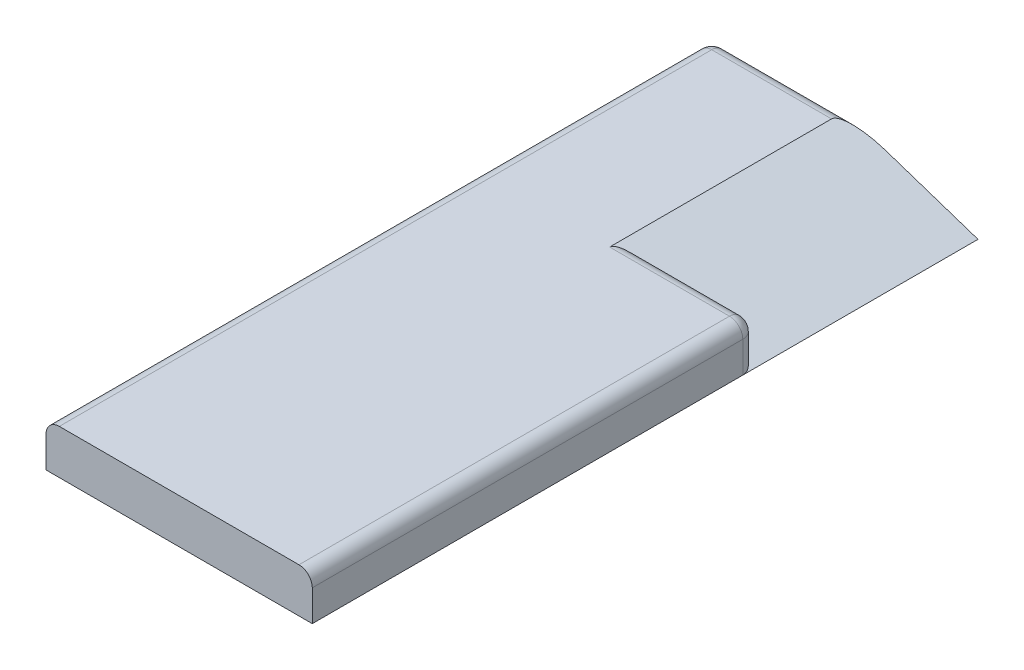
ISO-10303-21;
HEADER;
FILE_DESCRIPTION(('STEP AP214'),'2;1');
FILE_NAME('part.step','',(''),(''),'','','');
FILE_SCHEMA(('AUTOMOTIVE_DESIGN { 1 0 10303 214 1 1 1 1 }'));
ENDSEC;
DATA;
#1=APPLICATION_CONTEXT('core data for automotive mechanical design processes');
#2=APPLICATION_PROTOCOL_DEFINITION('international standard','automotive_design',2000,#1);
#3=PRODUCT_CONTEXT('',#1,'mechanical');
#4=PRODUCT('Part','Part','',(#3));
#5=PRODUCT_RELATED_PRODUCT_CATEGORY('part','',(#4));
#6=PRODUCT_DEFINITION_FORMATION('','',#4);
#7=PRODUCT_DEFINITION_CONTEXT('part definition',#1,'design');
#8=PRODUCT_DEFINITION('design','',#6,#7);
#9=PRODUCT_DEFINITION_SHAPE('','',#8);
#10=(LENGTH_UNIT() NAMED_UNIT(*) SI_UNIT(.MILLI.,.METRE.));
#11=(NAMED_UNIT(*) PLANE_ANGLE_UNIT() SI_UNIT($,.RADIAN.));
#12=(NAMED_UNIT(*) SI_UNIT($,.STERADIAN.) SOLID_ANGLE_UNIT());
#13=UNCERTAINTY_MEASURE_WITH_UNIT(LENGTH_MEASURE(1.E-05),#10,'distance_accuracy_value','');
#14=(GEOMETRIC_REPRESENTATION_CONTEXT(3) GLOBAL_UNCERTAINTY_ASSIGNED_CONTEXT((#13)) GLOBAL_UNIT_ASSIGNED_CONTEXT((#10,
#11,#12)) REPRESENTATION_CONTEXT('',''));
#15=CARTESIAN_POINT('',(0.,0.,0.));
#16=DIRECTION('',(0.,0.,1.));
#17=DIRECTION('',(1.,0.,0.));
#18=AXIS2_PLACEMENT_3D('',#15,#16,#17);
#19=CARTESIAN_POINT('',(-30.,5.,150.));
#20=DIRECTION('',(0.,1.,0.));
#21=DIRECTION('',(0.,0.,1.));
#22=AXIS2_PLACEMENT_3D('',#19,#20,#21);
#23=PLANE('',#22);
#24=DIRECTION('',(1.,0.,0.));
#25=VECTOR('',#24,1.);
#26=CARTESIAN_POINT('',(-30.,5.,150.));
#27=LINE('',#26,#25);
#28=CARTESIAN_POINT('',(-27.,5.,150.));
#29=VERTEX_POINT('',#28);
#30=CARTESIAN_POINT('',(27.,5.,150.));
#31=VERTEX_POINT('',#30);
#32=EDGE_CURVE('E131',#29,#31,#27,.T.);
#33=ORIENTED_EDGE('',*,*,#32,.T.);
#34=DIRECTION('',(0.,0.,-1.));
#35=VECTOR('',#34,1.);
#36=CARTESIAN_POINT('',(27.,5.,150.));
#37=LINE('',#36,#35);
#38=CARTESIAN_POINT('',(27.,5.,53.));
#39=VERTEX_POINT('',#38);
#40=EDGE_CURVE('E222',#31,#39,#37,.T.);
#41=ORIENTED_EDGE('',*,*,#40,.T.);
#42=DIRECTION('',(1.,0.,0.));
#43=VECTOR('',#42,1.);
#44=CARTESIAN_POINT('',(-30.,5.,53.));
#45=LINE('',#44,#43);
#46=CARTESIAN_POINT('',(0.,5.,53.));
#47=VERTEX_POINT('',#46);
#48=EDGE_CURVE('E169',#39,#47,#45,.F.);
#49=ORIENTED_EDGE('',*,*,#48,.T.);
#50=DIRECTION('',(0.,0.,1.));
#51=VECTOR('',#50,1.);
#52=CARTESIAN_POINT('',(0.,5.,-202.330175702983));
#53=LINE('',#52,#51);
#54=CARTESIAN_POINT('',(0.,5.,3.));
#55=VERTEX_POINT('',#54);
#56=EDGE_CURVE('E245',#55,#47,#53,.T.);
#57=ORIENTED_EDGE('',*,*,#56,.F.);
#58=DIRECTION('',(1.,0.,0.));
#59=VECTOR('',#58,1.);
#60=CARTESIAN_POINT('',(-30.,5.,3.));
#61=LINE('',#60,#59);
#62=CARTESIAN_POINT('',(-27.,5.,3.));
#63=VERTEX_POINT('',#62);
#64=EDGE_CURVE('E165',#55,#63,#61,.F.);
#65=ORIENTED_EDGE('',*,*,#64,.T.);
#66=DIRECTION('',(0.,0.,-1.));
#67=VECTOR('',#66,1.);
#68=CARTESIAN_POINT('',(-27.,5.,150.));
#69=LINE('',#68,#67);
#70=EDGE_CURVE('E200',#63,#29,#69,.F.);
#71=ORIENTED_EDGE('',*,*,#70,.T.);
#72=EDGE_LOOP('',(#33,#41,#49,#57,#65,#71));
#73=FACE_BOUND('',#72,.T.);
#74=ADVANCED_FACE('F44',(#73),#23,.T.);
#75=CARTESIAN_POINT('',(-30.,5.,150.));
#76=DIRECTION('',(1.,0.,0.));
#77=DIRECTION('',(0.,1.,0.));
#78=AXIS2_PLACEMENT_3D('',#75,#76,#77);
#79=PLANE('',#78);
#80=DIRECTION('',(0.,0.,-1.));
#81=VECTOR('',#80,1.);
#82=CARTESIAN_POINT('',(-30.,2.,3.));
#83=LINE('',#82,#81);
#84=CARTESIAN_POINT('',(-30.,2.,150.));
#85=VERTEX_POINT('',#84);
#86=CARTESIAN_POINT('',(-30.,2.,3.));
#87=VERTEX_POINT('',#86);
#88=EDGE_CURVE('E184',#85,#87,#83,.T.);
#89=ORIENTED_EDGE('',*,*,#88,.T.);
#90=DIRECTION('',(0.,-1.,0.));
#91=VECTOR('',#90,1.);
#92=CARTESIAN_POINT('',(-30.,-5.,3.));
#93=LINE('',#92,#91);
#94=CARTESIAN_POINT('',(-30.,-5.,3.));
#95=VERTEX_POINT('',#94);
#96=EDGE_CURVE('E187',#87,#95,#93,.T.);
#97=ORIENTED_EDGE('',*,*,#96,.T.);
#98=DIRECTION('',(0.,0.,-1.));
#99=VECTOR('',#98,1.);
#100=CARTESIAN_POINT('',(-30.,-5.,150.));
#101=LINE('',#100,#99);
#102=CARTESIAN_POINT('',(-30.,-5.,150.));
#103=VERTEX_POINT('',#102);
#104=EDGE_CURVE('E146',#103,#95,#101,.T.);
#105=ORIENTED_EDGE('',*,*,#104,.F.);
#106=DIRECTION('',(0.,-1.,0.));
#107=VECTOR('',#106,1.);
#108=CARTESIAN_POINT('',(-30.,5.,150.));
#109=LINE('',#108,#107);
#110=EDGE_CURVE('E136',#85,#103,#109,.T.);
#111=ORIENTED_EDGE('',*,*,#110,.F.);
#112=EDGE_LOOP('',(#89,#97,#105,#111));
#113=FACE_BOUND('',#112,.T.);
#114=ADVANCED_FACE('F284',(#113),#79,.F.);
#115=CARTESIAN_POINT('',(-30.,-5.,150.));
#116=DIRECTION('',(0.,1.,0.));
#117=DIRECTION('',(0.,0.,1.));
#118=AXIS2_PLACEMENT_3D('',#115,#116,#117);
#119=PLANE('',#118);
#120=ORIENTED_EDGE('',*,*,#104,.T.);
#121=CARTESIAN_POINT('',(-27.,-5.,3.));
#122=DIRECTION('',(0.,1.,0.));
#123=DIRECTION('',(0.,0.,1.));
#124=AXIS2_PLACEMENT_3D('',#121,#122,#123);
#125=CIRCLE('',#124,3.);
#126=CARTESIAN_POINT('',(-27.,-5.,0.));
#127=VERTEX_POINT('',#126);
#128=EDGE_CURVE('E191',#95,#127,#125,.F.);
#129=ORIENTED_EDGE('',*,*,#128,.T.);
#130=DIRECTION('',(1.,0.,0.));
#131=VECTOR('',#130,1.);
#132=CARTESIAN_POINT('',(-30.,-5.,0.));
#133=LINE('',#132,#131);
#134=CARTESIAN_POINT('',(30.,-5.,0.));
#135=VERTEX_POINT('',#134);
#136=EDGE_CURVE('E254',#127,#135,#133,.T.);
#137=ORIENTED_EDGE('',*,*,#136,.T.);
#138=DIRECTION('',(0.,0.,1.));
#139=VECTOR('',#138,1.);
#140=CARTESIAN_POINT('',(30.,-5.,-202.330175702983));
#141=LINE('',#140,#139);
#142=CARTESIAN_POINT('',(30.,-5.,53.));
#143=VERTEX_POINT('',#142);
#144=EDGE_CURVE('E144',#135,#143,#141,.T.);
#145=ORIENTED_EDGE('',*,*,#144,.T.);
#146=DIRECTION('',(0.,0.,-1.));
#147=VECTOR('',#146,1.);
#148=CARTESIAN_POINT('',(30.,-5.,150.));
#149=LINE('',#148,#147);
#150=CARTESIAN_POINT('',(30.,-5.,150.));
#151=VERTEX_POINT('',#150);
#152=EDGE_CURVE('E127',#151,#143,#149,.T.);
#153=ORIENTED_EDGE('',*,*,#152,.F.);
#154=DIRECTION('',(1.,0.,0.));
#155=VECTOR('',#154,1.);
#156=CARTESIAN_POINT('',(-30.,-5.,150.));
#157=LINE('',#156,#155);
#158=EDGE_CURVE('E130',#103,#151,#157,.T.);
#159=ORIENTED_EDGE('',*,*,#158,.F.);
#160=EDGE_LOOP('',(#120,#129,#137,#145,#153,#159));
#161=FACE_BOUND('',#160,.T.);
#162=ADVANCED_FACE('F142',(#161),#119,.F.);
#163=CARTESIAN_POINT('',(30.,5.,150.));
#164=DIRECTION('',(1.,0.,0.));
#165=DIRECTION('',(0.,0.,-1.));
#166=AXIS2_PLACEMENT_3D('',#163,#164,#165);
#167=PLANE('',#166);
#168=DIRECTION('',(0.,-1.,0.));
#169=VECTOR('',#168,1.);
#170=CARTESIAN_POINT('',(30.,5.,53.));
#171=LINE('',#170,#169);
#172=CARTESIAN_POINT('',(30.,2.,53.));
#173=VERTEX_POINT('',#172);
#174=EDGE_CURVE('E162',#143,#173,#171,.F.);
#175=ORIENTED_EDGE('',*,*,#174,.T.);
#176=DIRECTION('',(0.,0.,-1.));
#177=VECTOR('',#176,1.);
#178=CARTESIAN_POINT('',(30.,2.,150.));
#179=LINE('',#178,#177);
#180=CARTESIAN_POINT('',(30.,2.,150.));
#181=VERTEX_POINT('',#180);
#182=EDGE_CURVE('E54',#173,#181,#179,.F.);
#183=ORIENTED_EDGE('',*,*,#182,.T.);
#184=DIRECTION('',(0.,-1.,0.));
#185=VECTOR('',#184,1.);
#186=CARTESIAN_POINT('',(30.,5.,150.));
#187=LINE('',#186,#185);
#188=EDGE_CURVE('E123',#181,#151,#187,.T.);
#189=ORIENTED_EDGE('',*,*,#188,.T.);
#190=ORIENTED_EDGE('',*,*,#152,.T.);
#191=EDGE_LOOP('',(#175,#183,#189,#190));
#192=FACE_BOUND('',#191,.T.);
#193=ADVANCED_FACE('F125',(#192),#167,.T.);
#194=CARTESIAN_POINT('',(0.,0.,150.));
#195=DIRECTION('',(0.,0.,-1.));
#196=DIRECTION('',(-1.,0.,0.));
#197=AXIS2_PLACEMENT_3D('',#194,#195,#196);
#198=PLANE('',#197);
#199=ORIENTED_EDGE('',*,*,#188,.F.);
#200=CARTESIAN_POINT('',(27.,2.,150.));
#201=DIRECTION('',(0.,0.,-1.));
#202=DIRECTION('',(-1.,0.,0.));
#203=AXIS2_PLACEMENT_3D('',#200,#201,#202);
#204=CIRCLE('',#203,3.);
#205=EDGE_CURVE('E11',#181,#31,#204,.F.);
#206=ORIENTED_EDGE('',*,*,#205,.T.);
#207=ORIENTED_EDGE('',*,*,#32,.F.);
#208=CARTESIAN_POINT('',(-27.,2.,150.));
#209=DIRECTION('',(0.,0.,-1.));
#210=DIRECTION('',(-1.,0.,0.));
#211=AXIS2_PLACEMENT_3D('',#208,#209,#210);
#212=CIRCLE('',#211,3.);
#213=EDGE_CURVE('E203',#29,#85,#212,.F.);
#214=ORIENTED_EDGE('',*,*,#213,.T.);
#215=ORIENTED_EDGE('',*,*,#110,.T.);
#216=ORIENTED_EDGE('',*,*,#158,.T.);
#217=EDGE_LOOP('',(#199,#206,#207,#214,#215,#216));
#218=FACE_BOUND('',#217,.T.);
#219=ADVANCED_FACE('F134',(#218),#198,.F.);
#220=CARTESIAN_POINT('',(0.,0.,0.));
#221=DIRECTION('',(0.,0.,-1.));
#222=DIRECTION('',(-1.,0.,0.));
#223=AXIS2_PLACEMENT_3D('',#220,#221,#222);
#224=PLANE('',#223);
#225=ORIENTED_EDGE('',*,*,#136,.F.);
#226=DIRECTION('',(0.,-1.,0.));
#227=VECTOR('',#226,1.);
#228=CARTESIAN_POINT('',(-27.,2.,0.));
#229=LINE('',#228,#227);
#230=CARTESIAN_POINT('',(-27.,2.,0.));
#231=VERTEX_POINT('',#230);
#232=EDGE_CURVE('E194',#127,#231,#229,.F.);
#233=ORIENTED_EDGE('',*,*,#232,.T.);
#234=DIRECTION('',(1.,0.,0.));
#235=VECTOR('',#234,1.);
#236=CARTESIAN_POINT('',(0.,2.,0.));
#237=LINE('',#236,#235);
#238=CARTESIAN_POINT('',(9.00000000000001,2.,0.));
#239=VERTEX_POINT('',#238);
#240=EDGE_CURVE('E172',#231,#239,#237,.T.);
#241=ORIENTED_EDGE('',*,*,#240,.T.);
#242=DIRECTION('',(-0.948683298050514,0.316227766016838,0.));
#243=VECTOR('',#242,1.);
#244=CARTESIAN_POINT('',(30.,-5.,0.));
#245=LINE('',#244,#243);
#246=EDGE_CURVE('E250',#135,#239,#245,.T.);
#247=ORIENTED_EDGE('',*,*,#246,.F.);
#248=EDGE_LOOP('',(#225,#233,#241,#247));
#249=FACE_BOUND('',#248,.T.);
#250=ADVANCED_FACE('F262',(#249),#224,.T.);
#251=CARTESIAN_POINT('',(30.,-5.,-202.330175702983));
#252=DIRECTION('',(0.316227766016838,0.948683298050514,0.));
#253=DIRECTION('',(-0.948683298050514,0.316227766016838,0.));
#254=AXIS2_PLACEMENT_3D('',#251,#252,#253);
#255=PLANE('',#254);
#256=ORIENTED_EDGE('',*,*,#246,.T.);
#257=CARTESIAN_POINT('',(9.00000000000001,2.,3.));
#258=DIRECTION('',(0.316227766016838,0.948683298050514,0.));
#259=DIRECTION('',(0.948683298050514,-0.316227766016838,0.));
#260=AXIS2_PLACEMENT_3D('',#257,#258,#259);
#261=ELLIPSE('',#260,9.48683298050513,3.);
#262=EDGE_CURVE('E175',#239,#55,#261,.T.);
#263=ORIENTED_EDGE('',*,*,#262,.T.);
#264=ORIENTED_EDGE('',*,*,#56,.T.);
#265=CARTESIAN_POINT('',(9.00000000000001,2.,53.));
#266=DIRECTION('',(0.316227766016838,0.948683298050514,0.));
#267=DIRECTION('',(0.948683298050514,-0.316227766016838,0.));
#268=AXIS2_PLACEMENT_3D('',#265,#266,#267);
#269=ELLIPSE('',#268,9.48683298050513,3.);
#270=CARTESIAN_POINT('',(9.00000000000001,2.,50.));
#271=VERTEX_POINT('',#270);
#272=EDGE_CURVE('E181',#47,#271,#269,.F.);
#273=ORIENTED_EDGE('',*,*,#272,.T.);
#274=DIRECTION('',(-0.948683298050514,0.316227766016838,0.));
#275=VECTOR('',#274,1.);
#276=CARTESIAN_POINT('',(30.,-5.,50.));
#277=LINE('',#276,#275);
#278=CARTESIAN_POINT('',(27.,-4.,50.));
#279=VERTEX_POINT('',#278);
#280=EDGE_CURVE('E215',#279,#271,#277,.T.);
#281=ORIENTED_EDGE('',*,*,#280,.F.);
#282=CARTESIAN_POINT('',(27.,-4.,53.));
#283=DIRECTION('',(0.316227766016838,0.948683298050514,0.));
#284=DIRECTION('',(0.948683298050514,-0.316227766016838,0.));
#285=AXIS2_PLACEMENT_3D('',#282,#283,#284);
#286=ELLIPSE('',#285,3.16227766016838,3.);
#287=EDGE_CURVE('E178',#279,#143,#286,.F.);
#288=ORIENTED_EDGE('',*,*,#287,.T.);
#289=ORIENTED_EDGE('',*,*,#144,.F.);
#290=EDGE_LOOP('',(#256,#263,#264,#273,#281,#288,#289));
#291=FACE_BOUND('',#290,.T.);
#292=ADVANCED_FACE('F266',(#291),#255,.T.);
#293=CARTESIAN_POINT('',(0.,0.,50.));
#294=DIRECTION('',(0.,0.,-1.));
#295=DIRECTION('',(-1.,0.,0.));
#296=AXIS2_PLACEMENT_3D('',#293,#294,#295);
#297=PLANE('',#296);
#298=DIRECTION('',(1.,0.,0.));
#299=VECTOR('',#298,1.);
#300=CARTESIAN_POINT('',(0.,2.,50.));
#301=LINE('',#300,#299);
#302=CARTESIAN_POINT('',(27.,2.,50.));
#303=VERTEX_POINT('',#302);
#304=EDGE_CURVE('E150',#271,#303,#301,.T.);
#305=ORIENTED_EDGE('',*,*,#304,.T.);
#306=DIRECTION('',(0.,-1.,0.));
#307=VECTOR('',#306,1.);
#308=CARTESIAN_POINT('',(27.,0.,50.));
#309=LINE('',#308,#307);
#310=EDGE_CURVE('E158',#303,#279,#309,.T.);
#311=ORIENTED_EDGE('',*,*,#310,.T.);
#312=ORIENTED_EDGE('',*,*,#280,.T.);
#313=EDGE_LOOP('',(#305,#311,#312));
#314=FACE_BOUND('',#313,.T.);
#315=ADVANCED_FACE('F273',(#314),#297,.T.);
#316=CARTESIAN_POINT('',(0.,2.,53.));
#317=DIRECTION('',(1.,0.,0.));
#318=DIRECTION('',(0.,0.,-1.));
#319=AXIS2_PLACEMENT_3D('',#316,#317,#318);
#320=CYLINDRICAL_SURFACE('',#319,3.);
#321=ORIENTED_EDGE('',*,*,#48,.F.);
#322=CARTESIAN_POINT('',(27.,2.,53.));
#323=DIRECTION('',(1.,0.,0.));
#324=DIRECTION('',(0.,0.,-1.));
#325=AXIS2_PLACEMENT_3D('',#322,#323,#324);
#326=CIRCLE('',#325,3.);
#327=EDGE_CURVE('E219',#39,#303,#326,.F.);
#328=ORIENTED_EDGE('',*,*,#327,.T.);
#329=ORIENTED_EDGE('',*,*,#304,.F.);
#330=ORIENTED_EDGE('',*,*,#272,.F.);
#331=EDGE_LOOP('',(#321,#328,#329,#330));
#332=FACE_BOUND('',#331,.T.);
#333=ADVANCED_FACE('F236',(#332),#320,.T.);
#334=CARTESIAN_POINT('',(27.,0.,53.));
#335=DIRECTION('',(0.,-1.,0.));
#336=DIRECTION('',(0.,0.,-1.));
#337=AXIS2_PLACEMENT_3D('',#334,#335,#336);
#338=CYLINDRICAL_SURFACE('',#337,3.);
#339=ORIENTED_EDGE('',*,*,#310,.F.);
#340=CARTESIAN_POINT('',(27.,2.,53.));
#341=DIRECTION('',(0.,-1.,0.));
#342=DIRECTION('',(0.,0.,-1.));
#343=AXIS2_PLACEMENT_3D('',#340,#341,#342);
#344=CIRCLE('',#343,3.);
#345=EDGE_CURVE('E206',#303,#173,#344,.T.);
#346=ORIENTED_EDGE('',*,*,#345,.T.);
#347=ORIENTED_EDGE('',*,*,#174,.F.);
#348=ORIENTED_EDGE('',*,*,#287,.F.);
#349=EDGE_LOOP('',(#339,#346,#347,#348));
#350=FACE_BOUND('',#349,.T.);
#351=ADVANCED_FACE('F271',(#350),#338,.T.);
#352=CARTESIAN_POINT('',(0.,2.,3.));
#353=DIRECTION('',(1.,0.,0.));
#354=DIRECTION('',(0.,0.,-1.));
#355=AXIS2_PLACEMENT_3D('',#352,#353,#354);
#356=CYLINDRICAL_SURFACE('',#355,3.);
#357=ORIENTED_EDGE('',*,*,#240,.F.);
#358=CARTESIAN_POINT('',(-27.,2.,3.));
#359=DIRECTION('',(1.,0.,0.));
#360=DIRECTION('',(0.,0.,-1.));
#361=AXIS2_PLACEMENT_3D('',#358,#359,#360);
#362=CIRCLE('',#361,3.);
#363=EDGE_CURVE('E197',#231,#63,#362,.T.);
#364=ORIENTED_EDGE('',*,*,#363,.T.);
#365=ORIENTED_EDGE('',*,*,#64,.F.);
#366=ORIENTED_EDGE('',*,*,#262,.F.);
#367=EDGE_LOOP('',(#357,#364,#365,#366));
#368=FACE_BOUND('',#367,.T.);
#369=ADVANCED_FACE('F295',(#368),#356,.T.);
#370=CARTESIAN_POINT('',(-27.,2.,150.));
#371=DIRECTION('',(0.,0.,1.));
#372=DIRECTION('',(1.,0.,0.));
#373=AXIS2_PLACEMENT_3D('',#370,#371,#372);
#374=CYLINDRICAL_SURFACE('',#373,3.);
#375=ORIENTED_EDGE('',*,*,#213,.F.);
#376=ORIENTED_EDGE('',*,*,#70,.F.);
#377=CARTESIAN_POINT('',(-27.,2.,3.));
#378=DIRECTION('',(0.,0.,-1.));
#379=DIRECTION('',(0.,1.,0.));
#380=AXIS2_PLACEMENT_3D('',#377,#378,#379);
#381=CIRCLE('',#380,3.);
#382=EDGE_CURVE('E211',#87,#63,#381,.T.);
#383=ORIENTED_EDGE('',*,*,#382,.F.);
#384=ORIENTED_EDGE('',*,*,#88,.F.);
#385=EDGE_LOOP('',(#375,#376,#383,#384));
#386=FACE_BOUND('',#385,.T.);
#387=ADVANCED_FACE('F299',(#386),#374,.T.);
#388=CARTESIAN_POINT('',(-27.,2.,3.));
#389=DIRECTION('',(1.,0.,0.));
#390=DIRECTION('',(0.,1.,0.));
#391=AXIS2_PLACEMENT_3D('',#388,#389,#390);
#392=SPHERICAL_SURFACE('',#391,3.);
#393=ORIENTED_EDGE('',*,*,#382,.T.);
#394=ORIENTED_EDGE('',*,*,#363,.F.);
#395=CARTESIAN_POINT('',(-27.,2.,3.));
#396=DIRECTION('',(0.,-1.,0.));
#397=DIRECTION('',(1.,0.,0.));
#398=AXIS2_PLACEMENT_3D('',#395,#396,#397);
#399=CIRCLE('',#398,3.);
#400=EDGE_CURVE('E207',#87,#231,#399,.T.);
#401=ORIENTED_EDGE('',*,*,#400,.F.);
#402=EDGE_LOOP('',(#393,#394,#401));
#403=FACE_BOUND('',#402,.T.);
#404=ADVANCED_FACE('F304',(#403),#392,.T.);
#405=CARTESIAN_POINT('',(-27.,5.,3.));
#406=DIRECTION('',(0.,1.,0.));
#407=DIRECTION('',(-1.,0.,0.));
#408=AXIS2_PLACEMENT_3D('',#405,#406,#407);
#409=CYLINDRICAL_SURFACE('',#408,3.);
#410=ORIENTED_EDGE('',*,*,#400,.T.);
#411=ORIENTED_EDGE('',*,*,#232,.F.);
#412=ORIENTED_EDGE('',*,*,#128,.F.);
#413=ORIENTED_EDGE('',*,*,#96,.F.);
#414=EDGE_LOOP('',(#410,#411,#412,#413));
#415=FACE_BOUND('',#414,.T.);
#416=ADVANCED_FACE('F301',(#415),#409,.T.);
#417=CARTESIAN_POINT('',(27.,2.,150.));
#418=DIRECTION('',(0.,0.,-1.));
#419=DIRECTION('',(-1.,0.,0.));
#420=AXIS2_PLACEMENT_3D('',#417,#418,#419);
#421=CYLINDRICAL_SURFACE('',#420,3.);
#422=ORIENTED_EDGE('',*,*,#205,.F.);
#423=ORIENTED_EDGE('',*,*,#182,.F.);
#424=CARTESIAN_POINT('',(27.,2.,53.));
#425=DIRECTION('',(0.,0.,-1.));
#426=DIRECTION('',(-1.,0.,0.));
#427=AXIS2_PLACEMENT_3D('',#424,#425,#426);
#428=CIRCLE('',#427,3.);
#429=EDGE_CURVE('E48',#39,#173,#428,.T.);
#430=ORIENTED_EDGE('',*,*,#429,.F.);
#431=ORIENTED_EDGE('',*,*,#40,.F.);
#432=EDGE_LOOP('',(#422,#423,#430,#431));
#433=FACE_BOUND('',#432,.T.);
#434=ADVANCED_FACE('F46',(#433),#421,.T.);
#435=CARTESIAN_POINT('',(27.,2.,53.));
#436=DIRECTION('',(0.,0.,1.));
#437=DIRECTION('',(1.,0.,0.));
#438=AXIS2_PLACEMENT_3D('',#435,#436,#437);
#439=SPHERICAL_SURFACE('',#438,3.);
#440=ORIENTED_EDGE('',*,*,#345,.F.);
#441=ORIENTED_EDGE('',*,*,#327,.F.);
#442=ORIENTED_EDGE('',*,*,#429,.T.);
#443=EDGE_LOOP('',(#440,#441,#442));
#444=FACE_BOUND('',#443,.T.);
#445=ADVANCED_FACE('F240',(#444),#439,.T.);
#446=CLOSED_SHELL('',(#74,#114,#162,#193,#219,#250,#292,#315,#333,#351,#369,#387,#404,#416,#434,#445));
#447=MANIFOLD_SOLID_BREP('B2',#446);
#448=ADVANCED_BREP_SHAPE_REPRESENTATION('',(#18,#447),#14);
#449=SHAPE_DEFINITION_REPRESENTATION(#9,#448);
ENDSEC;
END-ISO-10303-21;
